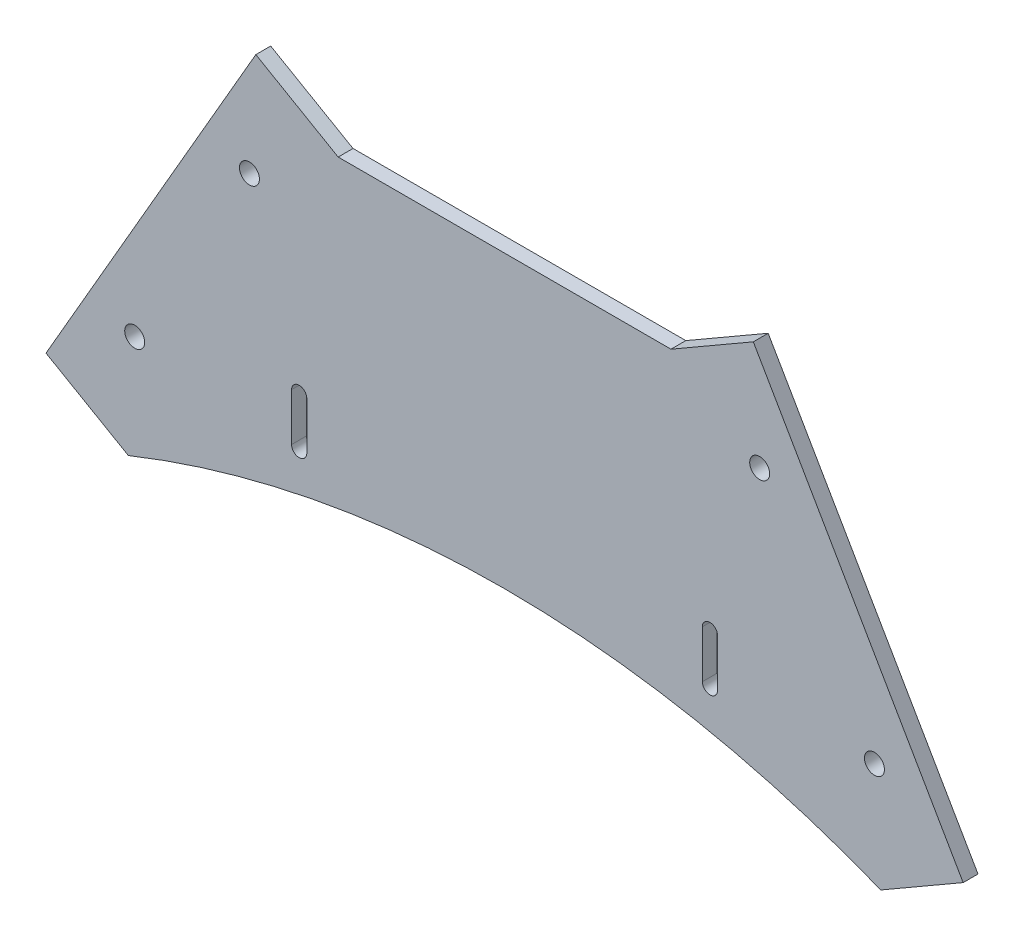
ISO-10303-21;
HEADER;
FILE_DESCRIPTION(('STEP AP214'),'2;1');
FILE_NAME('part.step','',(''),(''),'','','');
FILE_SCHEMA(('AUTOMOTIVE_DESIGN { 1 0 10303 214 1 1 1 1 }'));
ENDSEC;
DATA;
#1=APPLICATION_CONTEXT('core data for automotive mechanical design processes');
#2=APPLICATION_PROTOCOL_DEFINITION('international standard','automotive_design',2000,#1);
#3=PRODUCT_CONTEXT('',#1,'mechanical');
#4=PRODUCT('Part','Part','',(#3));
#5=PRODUCT_RELATED_PRODUCT_CATEGORY('part','',(#4));
#6=PRODUCT_DEFINITION_FORMATION('','',#4);
#7=PRODUCT_DEFINITION_CONTEXT('part definition',#1,'design');
#8=PRODUCT_DEFINITION('design','',#6,#7);
#9=PRODUCT_DEFINITION_SHAPE('','',#8);
#10=(LENGTH_UNIT() NAMED_UNIT(*) SI_UNIT(.MILLI.,.METRE.));
#11=(NAMED_UNIT(*) PLANE_ANGLE_UNIT() SI_UNIT($,.RADIAN.));
#12=(NAMED_UNIT(*) SI_UNIT($,.STERADIAN.) SOLID_ANGLE_UNIT());
#13=UNCERTAINTY_MEASURE_WITH_UNIT(LENGTH_MEASURE(1.E-05),#10,'distance_accuracy_value','');
#14=(GEOMETRIC_REPRESENTATION_CONTEXT(3) GLOBAL_UNCERTAINTY_ASSIGNED_CONTEXT((#13)) GLOBAL_UNIT_ASSIGNED_CONTEXT((#10,
#11,#12)) REPRESENTATION_CONTEXT('',''));
#15=CARTESIAN_POINT('',(0.,0.,0.));
#16=DIRECTION('',(0.,0.,1.));
#17=DIRECTION('',(1.,0.,0.));
#18=AXIS2_PLACEMENT_3D('',#15,#16,#17);
#19=CARTESIAN_POINT('',(96.4557505594944,-196.799575907765,3.125));
#20=DIRECTION('',(0.,0.,1.));
#21=DIRECTION('',(1.,0.,0.));
#22=AXIS2_PLACEMENT_3D('',#19,#20,#21);
#23=PLANE('',#22);
#24=CARTESIAN_POINT('',(150.116004597338,64.1239743106391,3.125));
#25=DIRECTION('',(0.,0.,1.));
#26=DIRECTION('',(1.,0.,0.));
#27=AXIS2_PLACEMENT_3D('',#24,#25,#26);
#28=CIRCLE('',#27,2.09999999999999);
#29=CARTESIAN_POINT('',(152.216004597338,64.1239743106391,3.125));
#30=VERTEX_POINT('',#29);
#31=EDGE_CURVE('E401',#30,#30,#28,.T.);
#32=ORIENTED_EDGE('',*,*,#31,.F.);
#33=EDGE_LOOP('',(#32));
#34=FACE_BOUND('',#33,.T.);
#35=CARTESIAN_POINT('',(42.7954965216511,64.1239743106392,3.125));
#36=DIRECTION('',(0.,0.,1.));
#37=DIRECTION('',(1.,0.,0.));
#38=AXIS2_PLACEMENT_3D('',#35,#36,#37);
#39=CIRCLE('',#38,2.10000000000002);
#40=CARTESIAN_POINT('',(44.8954965216512,64.1239743106392,3.125));
#41=VERTEX_POINT('',#40);
#42=EDGE_CURVE('E175',#41,#41,#39,.T.);
#43=ORIENTED_EDGE('',*,*,#42,.F.);
#44=EDGE_LOOP('',(#43));
#45=FACE_BOUND('',#44,.T.);
#46=CARTESIAN_POINT('',(96.4557505594944,-196.799575907765,3.125));
#47=DIRECTION('',(0.,0.,-1.));
#48=DIRECTION('',(1.,0.,0.));
#49=AXIS2_PLACEMENT_3D('',#46,#47,#48);
#50=CIRCLE('',#49,212.114260907765);
#51=CARTESIAN_POINT('',(17.3205080756887,1.6826817716975E-12,3.125));
#52=VERTEX_POINT('',#51);
#53=CARTESIAN_POINT('',(175.590993043302,1.9550500436325E-12,3.125));
#54=VERTEX_POINT('',#53);
#55=EDGE_CURVE('E216',#52,#54,#50,.T.);
#56=ORIENTED_EDGE('',*,*,#55,.T.);
#57=DIRECTION('',(0.866025403784439,0.499999999999999,0.));
#58=VECTOR('',#57,1.);
#59=CARTESIAN_POINT('',(175.590993043302,1.9550500436325E-12,3.125));
#60=LINE('',#59,#58);
#61=CARTESIAN_POINT('',(192.91150111899,10.0000000000016,3.125));
#62=VERTEX_POINT('',#61);
#63=EDGE_CURVE('E219',#54,#62,#60,.T.);
#64=ORIENTED_EDGE('',*,*,#63,.T.);
#65=DIRECTION('',(-0.499999999999998,0.86602540378444,0.));
#66=VECTOR('',#65,1.);
#67=CARTESIAN_POINT('',(148.776258635184,86.4444823863268,3.125));
#68=LINE('',#67,#66);
#69=CARTESIAN_POINT('',(148.776258635184,86.4444823863268,3.125));
#70=VERTEX_POINT('',#69);
#71=EDGE_CURVE('E222',#62,#70,#68,.T.);
#72=ORIENTED_EDGE('',*,*,#71,.T.);
#73=DIRECTION('',(-0.86602540378444,-0.499999999999997,0.));
#74=VECTOR('',#73,1.);
#75=CARTESIAN_POINT('',(131.455750559495,76.4444823863269,3.125));
#76=LINE('',#75,#74);
#77=CARTESIAN_POINT('',(131.455750559495,76.4444823863269,3.125));
#78=VERTEX_POINT('',#77);
#79=EDGE_CURVE('E224',#70,#78,#76,.T.);
#80=ORIENTED_EDGE('',*,*,#79,.T.);
#81=DIRECTION('',(-1.,0.,0.));
#82=VECTOR('',#81,1.);
#83=CARTESIAN_POINT('',(61.4557505594949,76.4444823863269,3.125));
#84=LINE('',#83,#82);
#85=CARTESIAN_POINT('',(61.4557505594949,76.4444823863269,3.125));
#86=VERTEX_POINT('',#85);
#87=EDGE_CURVE('E226',#78,#86,#84,.T.);
#88=ORIENTED_EDGE('',*,*,#87,.T.);
#89=DIRECTION('',(-0.86602540378444,0.499999999999998,0.));
#90=VECTOR('',#89,1.);
#91=CARTESIAN_POINT('',(61.4557505594949,76.4444823863269,3.125));
#92=LINE('',#91,#90);
#93=CARTESIAN_POINT('',(44.1352424838062,86.4444823863268,3.125));
#94=VERTEX_POINT('',#93);
#95=EDGE_CURVE('E228',#86,#94,#92,.T.);
#96=ORIENTED_EDGE('',*,*,#95,.T.);
#97=DIRECTION('',(-0.499999999999997,-0.86602540378444,0.));
#98=VECTOR('',#97,1.);
#99=CARTESIAN_POINT('',(44.1352424838062,86.4444823863268,3.125));
#100=LINE('',#99,#98);
#101=CARTESIAN_POINT('',(0.,10.0000000000016,3.125));
#102=VERTEX_POINT('',#101);
#103=EDGE_CURVE('E230',#94,#102,#100,.T.);
#104=ORIENTED_EDGE('',*,*,#103,.T.);
#105=DIRECTION('',(0.866025403784439,-0.499999999999999,0.));
#106=VECTOR('',#105,1.);
#107=CARTESIAN_POINT('',(17.3205080756887,1.6826817716975E-12,3.125));
#108=LINE('',#107,#106);
#109=EDGE_CURVE('E232',#102,#52,#108,.T.);
#110=ORIENTED_EDGE('',*,*,#109,.T.);
#111=EDGE_LOOP('',(#56,#64,#72,#80,#88,#96,#104,#110));
#112=FACE_BOUND('',#111,.T.);
#113=DIRECTION('',(0.,-1.,0.));
#114=VECTOR('',#113,1.);
#115=CARTESIAN_POINT('',(51.6557505594943,29.1748337660113,3.125));
#116=LINE('',#115,#114);
#117=CARTESIAN_POINT('',(51.6557505594943,29.1748337660113,3.125));
#118=VERTEX_POINT('',#117);
#119=CARTESIAN_POINT('',(51.6557505594943,19.1748337660114,3.125));
#120=VERTEX_POINT('',#119);
#121=EDGE_CURVE('E187',#118,#120,#116,.T.);
#122=ORIENTED_EDGE('',*,*,#121,.F.);
#123=CARTESIAN_POINT('',(53.2557505594943,29.1748337660113,3.125));
#124=DIRECTION('',(0.,0.,1.));
#125=DIRECTION('',(1.,0.,0.));
#126=AXIS2_PLACEMENT_3D('',#123,#124,#125);
#127=CIRCLE('',#126,1.59999999999999);
#128=CARTESIAN_POINT('',(54.8557505594943,29.1748337660113,3.125));
#129=VERTEX_POINT('',#128);
#130=EDGE_CURVE('E185',#129,#118,#127,.T.);
#131=ORIENTED_EDGE('',*,*,#130,.F.);
#132=DIRECTION('',(0.,1.,0.));
#133=VECTOR('',#132,1.);
#134=CARTESIAN_POINT('',(54.8557505594943,29.1748337660113,3.125));
#135=LINE('',#134,#133);
#136=CARTESIAN_POINT('',(54.8557505594943,19.1748337660114,3.125));
#137=VERTEX_POINT('',#136);
#138=EDGE_CURVE('E193',#137,#129,#135,.T.);
#139=ORIENTED_EDGE('',*,*,#138,.F.);
#140=CARTESIAN_POINT('',(53.2557505594943,19.1748337660114,3.125));
#141=DIRECTION('',(0.,0.,1.));
#142=DIRECTION('',(1.,0.,0.));
#143=AXIS2_PLACEMENT_3D('',#140,#141,#142);
#144=CIRCLE('',#143,1.59999999999999);
#145=EDGE_CURVE('E190',#120,#137,#144,.T.);
#146=ORIENTED_EDGE('',*,*,#145,.F.);
#147=EDGE_LOOP('',(#122,#131,#139,#146));
#148=FACE_BOUND('',#147,.T.);
#149=DIRECTION('',(0.,1.,0.));
#150=VECTOR('',#149,1.);
#151=CARTESIAN_POINT('',(141.255750559494,29.1748337660113,3.125));
#152=LINE('',#151,#150);
#153=CARTESIAN_POINT('',(141.255750559494,19.1748337660114,3.125));
#154=VERTEX_POINT('',#153);
#155=CARTESIAN_POINT('',(141.255750559494,29.1748337660113,3.125));
#156=VERTEX_POINT('',#155);
#157=EDGE_CURVE('E154',#154,#156,#152,.T.);
#158=ORIENTED_EDGE('',*,*,#157,.F.);
#159=CARTESIAN_POINT('',(139.655750559494,19.1748337660114,3.125));
#160=DIRECTION('',(0.,0.,1.));
#161=DIRECTION('',(1.,0.,0.));
#162=AXIS2_PLACEMENT_3D('',#159,#160,#161);
#163=CIRCLE('',#162,1.59999999999999);
#164=CARTESIAN_POINT('',(138.055750559494,19.1748337660114,3.125));
#165=VERTEX_POINT('',#164);
#166=EDGE_CURVE('E146',#165,#154,#163,.T.);
#167=ORIENTED_EDGE('',*,*,#166,.F.);
#168=DIRECTION('',(0.,-1.,0.));
#169=VECTOR('',#168,1.);
#170=CARTESIAN_POINT('',(138.055750559494,29.1748337660113,3.125));
#171=LINE('',#170,#169);
#172=CARTESIAN_POINT('',(138.055750559494,29.1748337660113,3.125));
#173=VERTEX_POINT('',#172);
#174=EDGE_CURVE('E169',#173,#165,#171,.T.);
#175=ORIENTED_EDGE('',*,*,#174,.F.);
#176=CARTESIAN_POINT('',(139.655750559494,29.1748337660113,3.125));
#177=DIRECTION('',(0.,0.,1.));
#178=DIRECTION('',(1.,0.,0.));
#179=AXIS2_PLACEMENT_3D('',#176,#177,#178);
#180=CIRCLE('',#179,1.59999999999999);
#181=EDGE_CURVE('E167',#156,#173,#180,.T.);
#182=ORIENTED_EDGE('',*,*,#181,.F.);
#183=EDGE_LOOP('',(#158,#167,#175,#182));
#184=FACE_BOUND('',#183,.T.);
#185=CARTESIAN_POINT('',(18.6602540378437,22.3205080756896,3.125));
#186=DIRECTION('',(0.,0.,1.));
#187=DIRECTION('',(1.,0.,0.));
#188=AXIS2_PLACEMENT_3D('',#185,#186,#187);
#189=CIRCLE('',#188,2.10000000000001);
#190=CARTESIAN_POINT('',(20.7602540378437,22.3205080756896,3.125));
#191=VERTEX_POINT('',#190);
#192=EDGE_CURVE('E407',#191,#191,#189,.T.);
#193=ORIENTED_EDGE('',*,*,#192,.F.);
#194=EDGE_LOOP('',(#193));
#195=FACE_BOUND('',#194,.T.);
#196=CARTESIAN_POINT('',(174.251247081145,22.3205080756895,3.125));
#197=DIRECTION('',(0.,0.,1.));
#198=DIRECTION('',(1.,0.,0.));
#199=AXIS2_PLACEMENT_3D('',#196,#197,#198);
#200=CIRCLE('',#199,2.09999999999999);
#201=CARTESIAN_POINT('',(176.351247081145,22.3205080756895,3.125));
#202=VERTEX_POINT('',#201);
#203=EDGE_CURVE('E392',#202,#202,#200,.T.);
#204=ORIENTED_EDGE('',*,*,#203,.F.);
#205=EDGE_LOOP('',(#204));
#206=FACE_BOUND('',#205,.T.);
#207=ADVANCED_FACE('F33',(#34,#45,#112,#148,#184,#195,#206),#23,.T.);
#208=CARTESIAN_POINT('',(96.4557505594944,-196.799575907765,0.));
#209=DIRECTION('',(0.,0.,1.));
#210=DIRECTION('',(1.,0.,0.));
#211=AXIS2_PLACEMENT_3D('',#208,#209,#210);
#212=PLANE('',#211);
#213=CARTESIAN_POINT('',(53.2557505594943,29.1748337660113,0.));
#214=DIRECTION('',(0.,0.,1.));
#215=DIRECTION('',(1.,0.,0.));
#216=AXIS2_PLACEMENT_3D('',#213,#214,#215);
#217=CIRCLE('',#216,1.59999999999999);
#218=CARTESIAN_POINT('',(54.8557505594943,29.1748337660113,0.));
#219=VERTEX_POINT('',#218);
#220=CARTESIAN_POINT('',(51.6557505594943,29.1748337660113,0.));
#221=VERTEX_POINT('',#220);
#222=EDGE_CURVE('E162',#219,#221,#217,.T.);
#223=ORIENTED_EDGE('',*,*,#222,.T.);
#224=DIRECTION('',(0.,-1.,0.));
#225=VECTOR('',#224,1.);
#226=CARTESIAN_POINT('',(51.6557505594943,29.1748337660113,0.));
#227=LINE('',#226,#225);
#228=CARTESIAN_POINT('',(51.6557505594943,19.1748337660114,0.));
#229=VERTEX_POINT('',#228);
#230=EDGE_CURVE('E198',#221,#229,#227,.T.);
#231=ORIENTED_EDGE('',*,*,#230,.T.);
#232=CARTESIAN_POINT('',(53.2557505594943,19.1748337660114,0.));
#233=DIRECTION('',(0.,0.,1.));
#234=DIRECTION('',(1.,0.,0.));
#235=AXIS2_PLACEMENT_3D('',#232,#233,#234);
#236=CIRCLE('',#235,1.59999999999999);
#237=CARTESIAN_POINT('',(54.8557505594943,19.1748337660114,0.));
#238=VERTEX_POINT('',#237);
#239=EDGE_CURVE('E201',#229,#238,#236,.T.);
#240=ORIENTED_EDGE('',*,*,#239,.T.);
#241=DIRECTION('',(0.,1.,0.));
#242=VECTOR('',#241,1.);
#243=CARTESIAN_POINT('',(54.8557505594943,29.1748337660113,0.));
#244=LINE('',#243,#242);
#245=EDGE_CURVE('E188',#238,#219,#244,.T.);
#246=ORIENTED_EDGE('',*,*,#245,.T.);
#247=EDGE_LOOP('',(#223,#231,#240,#246));
#248=FACE_BOUND('',#247,.T.);
#249=CARTESIAN_POINT('',(96.4557505594944,-196.799575907765,0.));
#250=DIRECTION('',(0.,0.,-1.));
#251=DIRECTION('',(1.,0.,0.));
#252=AXIS2_PLACEMENT_3D('',#249,#250,#251);
#253=CIRCLE('',#252,212.114260907765);
#254=CARTESIAN_POINT('',(17.3205080756887,1.6826817716975E-12,0.));
#255=VERTEX_POINT('',#254);
#256=CARTESIAN_POINT('',(175.590993043302,1.9550500436325E-12,0.));
#257=VERTEX_POINT('',#256);
#258=EDGE_CURVE('E215',#255,#257,#253,.T.);
#259=ORIENTED_EDGE('',*,*,#258,.F.);
#260=DIRECTION('',(0.866025403784439,-0.499999999999999,0.));
#261=VECTOR('',#260,1.);
#262=CARTESIAN_POINT('',(17.3205080756887,1.6826817716975E-12,0.));
#263=LINE('',#262,#261);
#264=CARTESIAN_POINT('',(0.,10.0000000000016,0.));
#265=VERTEX_POINT('',#264);
#266=EDGE_CURVE('E220',#265,#255,#263,.T.);
#267=ORIENTED_EDGE('',*,*,#266,.F.);
#268=DIRECTION('',(-0.499999999999997,-0.86602540378444,0.));
#269=VECTOR('',#268,1.);
#270=CARTESIAN_POINT('',(44.1352424838062,86.4444823863268,0.));
#271=LINE('',#270,#269);
#272=CARTESIAN_POINT('',(44.1352424838062,86.4444823863268,0.));
#273=VERTEX_POINT('',#272);
#274=EDGE_CURVE('E247',#273,#265,#271,.T.);
#275=ORIENTED_EDGE('',*,*,#274,.F.);
#276=DIRECTION('',(-0.86602540378444,0.499999999999998,0.));
#277=VECTOR('',#276,1.);
#278=CARTESIAN_POINT('',(61.4557505594949,76.4444823863269,0.));
#279=LINE('',#278,#277);
#280=CARTESIAN_POINT('',(61.4557505594949,76.4444823863269,0.));
#281=VERTEX_POINT('',#280);
#282=EDGE_CURVE('E245',#281,#273,#279,.T.);
#283=ORIENTED_EDGE('',*,*,#282,.F.);
#284=DIRECTION('',(-1.,0.,0.));
#285=VECTOR('',#284,1.);
#286=CARTESIAN_POINT('',(61.4557505594949,76.4444823863269,0.));
#287=LINE('',#286,#285);
#288=CARTESIAN_POINT('',(131.455750559495,76.4444823863269,0.));
#289=VERTEX_POINT('',#288);
#290=EDGE_CURVE('E243',#289,#281,#287,.T.);
#291=ORIENTED_EDGE('',*,*,#290,.F.);
#292=DIRECTION('',(-0.86602540378444,-0.499999999999997,0.));
#293=VECTOR('',#292,1.);
#294=CARTESIAN_POINT('',(131.455750559495,76.4444823863269,0.));
#295=LINE('',#294,#293);
#296=CARTESIAN_POINT('',(148.776258635184,86.4444823863268,0.));
#297=VERTEX_POINT('',#296);
#298=EDGE_CURVE('E241',#297,#289,#295,.T.);
#299=ORIENTED_EDGE('',*,*,#298,.F.);
#300=DIRECTION('',(-0.499999999999998,0.86602540378444,0.));
#301=VECTOR('',#300,1.);
#302=CARTESIAN_POINT('',(148.776258635184,86.4444823863268,0.));
#303=LINE('',#302,#301);
#304=CARTESIAN_POINT('',(192.91150111899,10.0000000000016,0.));
#305=VERTEX_POINT('',#304);
#306=EDGE_CURVE('E239',#305,#297,#303,.T.);
#307=ORIENTED_EDGE('',*,*,#306,.F.);
#308=DIRECTION('',(0.866025403784439,0.499999999999999,0.));
#309=VECTOR('',#308,1.);
#310=CARTESIAN_POINT('',(175.590993043302,1.9550500436325E-12,0.));
#311=LINE('',#310,#309);
#312=EDGE_CURVE('E237',#257,#305,#311,.T.);
#313=ORIENTED_EDGE('',*,*,#312,.F.);
#314=EDGE_LOOP('',(#259,#267,#275,#283,#291,#299,#307,#313));
#315=FACE_BOUND('',#314,.T.);
#316=CARTESIAN_POINT('',(139.655750559494,19.1748337660114,0.));
#317=DIRECTION('',(0.,0.,1.));
#318=DIRECTION('',(1.,0.,0.));
#319=AXIS2_PLACEMENT_3D('',#316,#317,#318);
#320=CIRCLE('',#319,1.59999999999999);
#321=CARTESIAN_POINT('',(138.055750559494,19.1748337660114,0.));
#322=VERTEX_POINT('',#321);
#323=CARTESIAN_POINT('',(141.255750559494,19.1748337660114,0.));
#324=VERTEX_POINT('',#323);
#325=EDGE_CURVE('E56',#322,#324,#320,.T.);
#326=ORIENTED_EDGE('',*,*,#325,.T.);
#327=DIRECTION('',(0.,1.,0.));
#328=VECTOR('',#327,1.);
#329=CARTESIAN_POINT('',(141.255750559494,29.1748337660113,0.));
#330=LINE('',#329,#328);
#331=CARTESIAN_POINT('',(141.255750559494,29.1748337660113,0.));
#332=VERTEX_POINT('',#331);
#333=EDGE_CURVE('E161',#324,#332,#330,.T.);
#334=ORIENTED_EDGE('',*,*,#333,.T.);
#335=CARTESIAN_POINT('',(139.655750559494,29.1748337660113,0.));
#336=DIRECTION('',(0.,0.,1.));
#337=DIRECTION('',(1.,0.,0.));
#338=AXIS2_PLACEMENT_3D('',#335,#336,#337);
#339=CIRCLE('',#338,1.59999999999999);
#340=CARTESIAN_POINT('',(138.055750559494,29.1748337660113,0.));
#341=VERTEX_POINT('',#340);
#342=EDGE_CURVE('E177',#332,#341,#339,.T.);
#343=ORIENTED_EDGE('',*,*,#342,.T.);
#344=DIRECTION('',(0.,-1.,0.));
#345=VECTOR('',#344,1.);
#346=CARTESIAN_POINT('',(138.055750559494,29.1748337660113,0.));
#347=LINE('',#346,#345);
#348=EDGE_CURVE('E155',#341,#322,#347,.T.);
#349=ORIENTED_EDGE('',*,*,#348,.T.);
#350=EDGE_LOOP('',(#326,#334,#343,#349));
#351=FACE_BOUND('',#350,.T.);
#352=CARTESIAN_POINT('',(42.7954965216511,64.1239743106392,0.));
#353=DIRECTION('',(0.,0.,1.));
#354=DIRECTION('',(1.,0.,0.));
#355=AXIS2_PLACEMENT_3D('',#352,#353,#354);
#356=CIRCLE('',#355,2.10000000000002);
#357=CARTESIAN_POINT('',(44.8954965216512,64.1239743106392,0.));
#358=VERTEX_POINT('',#357);
#359=EDGE_CURVE('E410',#358,#358,#356,.T.);
#360=ORIENTED_EDGE('',*,*,#359,.T.);
#361=EDGE_LOOP('',(#360));
#362=FACE_BOUND('',#361,.T.);
#363=CARTESIAN_POINT('',(18.6602540378437,22.3205080756896,0.));
#364=DIRECTION('',(0.,0.,1.));
#365=DIRECTION('',(1.,0.,0.));
#366=AXIS2_PLACEMENT_3D('',#363,#364,#365);
#367=CIRCLE('',#366,2.10000000000001);
#368=CARTESIAN_POINT('',(20.7602540378437,22.3205080756896,0.));
#369=VERTEX_POINT('',#368);
#370=EDGE_CURVE('E404',#369,#369,#367,.T.);
#371=ORIENTED_EDGE('',*,*,#370,.T.);
#372=EDGE_LOOP('',(#371));
#373=FACE_BOUND('',#372,.T.);
#374=CARTESIAN_POINT('',(150.116004597338,64.1239743106391,0.));
#375=DIRECTION('',(0.,0.,1.));
#376=DIRECTION('',(1.,0.,0.));
#377=AXIS2_PLACEMENT_3D('',#374,#375,#376);
#378=CIRCLE('',#377,2.09999999999999);
#379=CARTESIAN_POINT('',(152.216004597338,64.1239743106391,0.));
#380=VERTEX_POINT('',#379);
#381=EDGE_CURVE('E398',#380,#380,#378,.T.);
#382=ORIENTED_EDGE('',*,*,#381,.T.);
#383=EDGE_LOOP('',(#382));
#384=FACE_BOUND('',#383,.T.);
#385=CARTESIAN_POINT('',(174.251247081145,22.3205080756895,0.));
#386=DIRECTION('',(0.,0.,1.));
#387=DIRECTION('',(1.,0.,0.));
#388=AXIS2_PLACEMENT_3D('',#385,#386,#387);
#389=CIRCLE('',#388,2.09999999999999);
#390=CARTESIAN_POINT('',(176.351247081145,22.3205080756895,0.));
#391=VERTEX_POINT('',#390);
#392=EDGE_CURVE('E395',#391,#391,#389,.T.);
#393=ORIENTED_EDGE('',*,*,#392,.T.);
#394=EDGE_LOOP('',(#393));
#395=FACE_BOUND('',#394,.T.);
#396=ADVANCED_FACE('F277',(#248,#315,#351,#362,#373,#384,#395),#212,.F.);
#397=CARTESIAN_POINT('',(96.4557505594944,-196.799575907765,3.125));
#398=DIRECTION('',(0.,0.,-1.));
#399=DIRECTION('',(-1.,0.,0.));
#400=AXIS2_PLACEMENT_3D('',#397,#398,#399);
#401=CYLINDRICAL_SURFACE('',#400,212.114260907765);
#402=ORIENTED_EDGE('',*,*,#258,.T.);
#403=DIRECTION('',(0.,0.,-1.));
#404=VECTOR('',#403,1.);
#405=CARTESIAN_POINT('',(175.590993043302,1.9550500436325E-12,3.125));
#406=LINE('',#405,#404);
#407=EDGE_CURVE('E11',#54,#257,#406,.T.);
#408=ORIENTED_EDGE('',*,*,#407,.F.);
#409=ORIENTED_EDGE('',*,*,#55,.F.);
#410=DIRECTION('',(0.,0.,-1.));
#411=VECTOR('',#410,1.);
#412=CARTESIAN_POINT('',(17.3205080756887,1.6826817716975E-12,3.125));
#413=LINE('',#412,#411);
#414=EDGE_CURVE('E234',#52,#255,#413,.T.);
#415=ORIENTED_EDGE('',*,*,#414,.T.);
#416=EDGE_LOOP('',(#402,#408,#409,#415));
#417=FACE_BOUND('',#416,.T.);
#418=ADVANCED_FACE('F35',(#417),#401,.F.);
#419=CARTESIAN_POINT('',(175.590993043302,1.9550500436325E-12,3.125));
#420=DIRECTION('',(-0.499999999999999,0.866025403784439,0.));
#421=DIRECTION('',(-0.866025403784439,-0.499999999999999,0.));
#422=AXIS2_PLACEMENT_3D('',#419,#420,#421);
#423=PLANE('',#422);
#424=ORIENTED_EDGE('',*,*,#312,.T.);
#425=DIRECTION('',(0.,0.,-1.));
#426=VECTOR('',#425,1.);
#427=CARTESIAN_POINT('',(192.91150111899,10.0000000000016,3.125));
#428=LINE('',#427,#426);
#429=EDGE_CURVE('E41',#62,#305,#428,.T.);
#430=ORIENTED_EDGE('',*,*,#429,.F.);
#431=ORIENTED_EDGE('',*,*,#63,.F.);
#432=ORIENTED_EDGE('',*,*,#407,.T.);
#433=EDGE_LOOP('',(#424,#430,#431,#432));
#434=FACE_BOUND('',#433,.T.);
#435=ADVANCED_FACE('F295',(#434),#423,.F.);
#436=CARTESIAN_POINT('',(148.776258635184,86.4444823863268,3.125));
#437=DIRECTION('',(-0.86602540378444,-0.499999999999998,0.));
#438=DIRECTION('',(0.499999999999998,-0.86602540378444,0.));
#439=AXIS2_PLACEMENT_3D('',#436,#437,#438);
#440=PLANE('',#439);
#441=ORIENTED_EDGE('',*,*,#306,.T.);
#442=DIRECTION('',(0.,0.,-1.));
#443=VECTOR('',#442,1.);
#444=CARTESIAN_POINT('',(148.776258635184,86.4444823863268,3.125));
#445=LINE('',#444,#443);
#446=EDGE_CURVE('E264',#70,#297,#445,.T.);
#447=ORIENTED_EDGE('',*,*,#446,.F.);
#448=ORIENTED_EDGE('',*,*,#71,.F.);
#449=ORIENTED_EDGE('',*,*,#429,.T.);
#450=EDGE_LOOP('',(#441,#447,#448,#449));
#451=FACE_BOUND('',#450,.T.);
#452=ADVANCED_FACE('F271',(#451),#440,.F.);
#453=CARTESIAN_POINT('',(131.455750559495,76.4444823863269,3.125));
#454=DIRECTION('',(0.499999999999997,-0.86602540378444,0.));
#455=DIRECTION('',(0.86602540378444,0.499999999999997,0.));
#456=AXIS2_PLACEMENT_3D('',#453,#454,#455);
#457=PLANE('',#456);
#458=ORIENTED_EDGE('',*,*,#298,.T.);
#459=DIRECTION('',(0.,0.,-1.));
#460=VECTOR('',#459,1.);
#461=CARTESIAN_POINT('',(131.455750559495,76.4444823863269,3.125));
#462=LINE('',#461,#460);
#463=EDGE_CURVE('E261',#78,#289,#462,.T.);
#464=ORIENTED_EDGE('',*,*,#463,.F.);
#465=ORIENTED_EDGE('',*,*,#79,.F.);
#466=ORIENTED_EDGE('',*,*,#446,.T.);
#467=EDGE_LOOP('',(#458,#464,#465,#466));
#468=FACE_BOUND('',#467,.T.);
#469=ADVANCED_FACE('F283',(#468),#457,.F.);
#470=CARTESIAN_POINT('',(61.4557505594949,76.4444823863269,3.125));
#471=DIRECTION('',(0.,-1.,0.));
#472=DIRECTION('',(1.,0.,0.));
#473=AXIS2_PLACEMENT_3D('',#470,#471,#472);
#474=PLANE('',#473);
#475=ORIENTED_EDGE('',*,*,#290,.T.);
#476=DIRECTION('',(0.,0.,-1.));
#477=VECTOR('',#476,1.);
#478=CARTESIAN_POINT('',(61.4557505594949,76.4444823863269,3.125));
#479=LINE('',#478,#477);
#480=EDGE_CURVE('E258',#86,#281,#479,.T.);
#481=ORIENTED_EDGE('',*,*,#480,.F.);
#482=ORIENTED_EDGE('',*,*,#87,.F.);
#483=ORIENTED_EDGE('',*,*,#463,.T.);
#484=EDGE_LOOP('',(#475,#481,#482,#483));
#485=FACE_BOUND('',#484,.T.);
#486=ADVANCED_FACE('F287',(#485),#474,.F.);
#487=CARTESIAN_POINT('',(61.4557505594949,76.4444823863269,3.125));
#488=DIRECTION('',(-0.499999999999998,-0.86602540378444,0.));
#489=DIRECTION('',(0.86602540378444,-0.499999999999998,0.));
#490=AXIS2_PLACEMENT_3D('',#487,#488,#489);
#491=PLANE('',#490);
#492=ORIENTED_EDGE('',*,*,#282,.T.);
#493=DIRECTION('',(0.,0.,-1.));
#494=VECTOR('',#493,1.);
#495=CARTESIAN_POINT('',(44.1352424838062,86.4444823863268,3.125));
#496=LINE('',#495,#494);
#497=EDGE_CURVE('E255',#94,#273,#496,.T.);
#498=ORIENTED_EDGE('',*,*,#497,.F.);
#499=ORIENTED_EDGE('',*,*,#95,.F.);
#500=ORIENTED_EDGE('',*,*,#480,.T.);
#501=EDGE_LOOP('',(#492,#498,#499,#500));
#502=FACE_BOUND('',#501,.T.);
#503=ADVANCED_FACE('F308',(#502),#491,.F.);
#504=CARTESIAN_POINT('',(44.1352424838062,86.4444823863268,3.125));
#505=DIRECTION('',(0.86602540378444,-0.499999999999997,0.));
#506=DIRECTION('',(0.499999999999997,0.86602540378444,0.));
#507=AXIS2_PLACEMENT_3D('',#504,#505,#506);
#508=PLANE('',#507);
#509=ORIENTED_EDGE('',*,*,#274,.T.);
#510=DIRECTION('',(0.,0.,-1.));
#511=VECTOR('',#510,1.);
#512=CARTESIAN_POINT('',(0.,10.0000000000016,3.125));
#513=LINE('',#512,#511);
#514=EDGE_CURVE('E252',#102,#265,#513,.T.);
#515=ORIENTED_EDGE('',*,*,#514,.F.);
#516=ORIENTED_EDGE('',*,*,#103,.F.);
#517=ORIENTED_EDGE('',*,*,#497,.T.);
#518=EDGE_LOOP('',(#509,#515,#516,#517));
#519=FACE_BOUND('',#518,.T.);
#520=ADVANCED_FACE('F306',(#519),#508,.F.);
#521=CARTESIAN_POINT('',(17.3205080756887,1.6826817716975E-12,3.125));
#522=DIRECTION('',(0.499999999999999,0.866025403784439,0.));
#523=DIRECTION('',(-0.866025403784439,0.499999999999999,0.));
#524=AXIS2_PLACEMENT_3D('',#521,#522,#523);
#525=PLANE('',#524);
#526=ORIENTED_EDGE('',*,*,#266,.T.);
#527=ORIENTED_EDGE('',*,*,#414,.F.);
#528=ORIENTED_EDGE('',*,*,#109,.F.);
#529=ORIENTED_EDGE('',*,*,#514,.T.);
#530=EDGE_LOOP('',(#526,#527,#528,#529));
#531=FACE_BOUND('',#530,.T.);
#532=ADVANCED_FACE('F301',(#531),#525,.F.);
#533=CARTESIAN_POINT('',(53.2557505594943,29.1748337660113,3.125));
#534=DIRECTION('',(0.,0.,-1.));
#535=DIRECTION('',(-1.,0.,0.));
#536=AXIS2_PLACEMENT_3D('',#533,#534,#535);
#537=CYLINDRICAL_SURFACE('',#536,1.59999999999999);
#538=ORIENTED_EDGE('',*,*,#222,.F.);
#539=DIRECTION('',(0.,0.,-1.));
#540=VECTOR('',#539,1.);
#541=CARTESIAN_POINT('',(54.8557505594943,29.1748337660113,3.125));
#542=LINE('',#541,#540);
#543=EDGE_CURVE('E195',#129,#219,#542,.T.);
#544=ORIENTED_EDGE('',*,*,#543,.F.);
#545=ORIENTED_EDGE('',*,*,#130,.T.);
#546=DIRECTION('',(0.,0.,-1.));
#547=VECTOR('',#546,1.);
#548=CARTESIAN_POINT('',(51.6557505594943,29.1748337660113,3.125));
#549=LINE('',#548,#547);
#550=EDGE_CURVE('E212',#118,#221,#549,.T.);
#551=ORIENTED_EDGE('',*,*,#550,.T.);
#552=EDGE_LOOP('',(#538,#544,#545,#551));
#553=FACE_BOUND('',#552,.T.);
#554=ADVANCED_FACE('F328',(#553),#537,.F.);
#555=CARTESIAN_POINT('',(51.6557505594943,29.1748337660113,3.125));
#556=DIRECTION('',(1.,0.,0.));
#557=DIRECTION('',(0.,0.,-1.));
#558=AXIS2_PLACEMENT_3D('',#555,#556,#557);
#559=PLANE('',#558);
#560=ORIENTED_EDGE('',*,*,#230,.F.);
#561=ORIENTED_EDGE('',*,*,#550,.F.);
#562=ORIENTED_EDGE('',*,*,#121,.T.);
#563=DIRECTION('',(0.,0.,-1.));
#564=VECTOR('',#563,1.);
#565=CARTESIAN_POINT('',(51.6557505594943,19.1748337660114,3.125));
#566=LINE('',#565,#564);
#567=EDGE_CURVE('E210',#120,#229,#566,.T.);
#568=ORIENTED_EDGE('',*,*,#567,.T.);
#569=EDGE_LOOP('',(#560,#561,#562,#568));
#570=FACE_BOUND('',#569,.T.);
#571=ADVANCED_FACE('F335',(#570),#559,.T.);
#572=CARTESIAN_POINT('',(53.2557505594943,19.1748337660114,3.125));
#573=DIRECTION('',(0.,0.,-1.));
#574=DIRECTION('',(-1.,0.,0.));
#575=AXIS2_PLACEMENT_3D('',#572,#573,#574);
#576=CYLINDRICAL_SURFACE('',#575,1.59999999999999);
#577=ORIENTED_EDGE('',*,*,#239,.F.);
#578=ORIENTED_EDGE('',*,*,#567,.F.);
#579=ORIENTED_EDGE('',*,*,#145,.T.);
#580=DIRECTION('',(0.,0.,-1.));
#581=VECTOR('',#580,1.);
#582=CARTESIAN_POINT('',(54.8557505594943,19.1748337660114,3.125));
#583=LINE('',#582,#581);
#584=EDGE_CURVE('E208',#137,#238,#583,.T.);
#585=ORIENTED_EDGE('',*,*,#584,.T.);
#586=EDGE_LOOP('',(#577,#578,#579,#585));
#587=FACE_BOUND('',#586,.T.);
#588=ADVANCED_FACE('F340',(#587),#576,.F.);
#589=CARTESIAN_POINT('',(54.8557505594943,29.1748337660113,3.125));
#590=DIRECTION('',(-1.,0.,0.));
#591=DIRECTION('',(0.,0.,1.));
#592=AXIS2_PLACEMENT_3D('',#589,#590,#591);
#593=PLANE('',#592);
#594=ORIENTED_EDGE('',*,*,#245,.F.);
#595=ORIENTED_EDGE('',*,*,#584,.F.);
#596=ORIENTED_EDGE('',*,*,#138,.T.);
#597=ORIENTED_EDGE('',*,*,#543,.T.);
#598=EDGE_LOOP('',(#594,#595,#596,#597));
#599=FACE_BOUND('',#598,.T.);
#600=ADVANCED_FACE('F347',(#599),#593,.T.);
#601=CARTESIAN_POINT('',(139.655750559494,19.1748337660114,3.125));
#602=DIRECTION('',(0.,0.,-1.));
#603=DIRECTION('',(-1.,0.,0.));
#604=AXIS2_PLACEMENT_3D('',#601,#602,#603);
#605=CYLINDRICAL_SURFACE('',#604,1.59999999999999);
#606=ORIENTED_EDGE('',*,*,#325,.F.);
#607=DIRECTION('',(0.,0.,-1.));
#608=VECTOR('',#607,1.);
#609=CARTESIAN_POINT('',(138.055750559494,19.1748337660114,3.125));
#610=LINE('',#609,#608);
#611=EDGE_CURVE('E150',#165,#322,#610,.T.);
#612=ORIENTED_EDGE('',*,*,#611,.F.);
#613=ORIENTED_EDGE('',*,*,#166,.T.);
#614=DIRECTION('',(0.,0.,-1.));
#615=VECTOR('',#614,1.);
#616=CARTESIAN_POINT('',(141.255750559494,19.1748337660114,3.125));
#617=LINE('',#616,#615);
#618=EDGE_CURVE('E149',#154,#324,#617,.T.);
#619=ORIENTED_EDGE('',*,*,#618,.T.);
#620=EDGE_LOOP('',(#606,#612,#613,#619));
#621=FACE_BOUND('',#620,.T.);
#622=ADVANCED_FACE('F148',(#621),#605,.F.);
#623=CARTESIAN_POINT('',(141.255750559494,29.1748337660113,3.125));
#624=DIRECTION('',(-1.,0.,0.));
#625=DIRECTION('',(0.,0.,1.));
#626=AXIS2_PLACEMENT_3D('',#623,#624,#625);
#627=PLANE('',#626);
#628=ORIENTED_EDGE('',*,*,#333,.F.);
#629=ORIENTED_EDGE('',*,*,#618,.F.);
#630=ORIENTED_EDGE('',*,*,#157,.T.);
#631=DIRECTION('',(0.,0.,-1.));
#632=VECTOR('',#631,1.);
#633=CARTESIAN_POINT('',(141.255750559494,29.1748337660113,3.125));
#634=LINE('',#633,#632);
#635=EDGE_CURVE('E163',#156,#332,#634,.T.);
#636=ORIENTED_EDGE('',*,*,#635,.T.);
#637=EDGE_LOOP('',(#628,#629,#630,#636));
#638=FACE_BOUND('',#637,.T.);
#639=ADVANCED_FACE('F158',(#638),#627,.T.);
#640=CARTESIAN_POINT('',(139.655750559494,29.1748337660113,3.125));
#641=DIRECTION('',(0.,0.,-1.));
#642=DIRECTION('',(-1.,0.,0.));
#643=AXIS2_PLACEMENT_3D('',#640,#641,#642);
#644=CYLINDRICAL_SURFACE('',#643,1.59999999999999);
#645=ORIENTED_EDGE('',*,*,#342,.F.);
#646=ORIENTED_EDGE('',*,*,#635,.F.);
#647=ORIENTED_EDGE('',*,*,#181,.T.);
#648=DIRECTION('',(0.,0.,-1.));
#649=VECTOR('',#648,1.);
#650=CARTESIAN_POINT('',(138.055750559494,29.1748337660113,3.125));
#651=LINE('',#650,#649);
#652=EDGE_CURVE('E48',#173,#341,#651,.T.);
#653=ORIENTED_EDGE('',*,*,#652,.T.);
#654=EDGE_LOOP('',(#645,#646,#647,#653));
#655=FACE_BOUND('',#654,.T.);
#656=ADVANCED_FACE('F365',(#655),#644,.F.);
#657=CARTESIAN_POINT('',(138.055750559494,29.1748337660113,3.125));
#658=DIRECTION('',(1.,0.,0.));
#659=DIRECTION('',(0.,0.,-1.));
#660=AXIS2_PLACEMENT_3D('',#657,#658,#659);
#661=PLANE('',#660);
#662=ORIENTED_EDGE('',*,*,#348,.F.);
#663=ORIENTED_EDGE('',*,*,#652,.F.);
#664=ORIENTED_EDGE('',*,*,#174,.T.);
#665=ORIENTED_EDGE('',*,*,#611,.T.);
#666=EDGE_LOOP('',(#662,#663,#664,#665));
#667=FACE_BOUND('',#666,.T.);
#668=ADVANCED_FACE('F368',(#667),#661,.T.);
#669=CARTESIAN_POINT('',(42.7954965216511,64.1239743106392,3.125));
#670=DIRECTION('',(0.,0.,-1.));
#671=DIRECTION('',(-1.,0.,0.));
#672=AXIS2_PLACEMENT_3D('',#669,#670,#671);
#673=CYLINDRICAL_SURFACE('',#672,2.10000000000002);
#674=ORIENTED_EDGE('',*,*,#42,.T.);
#675=EDGE_LOOP('',(#674));
#676=FACE_BOUND('',#675,.T.);
#677=ORIENTED_EDGE('',*,*,#359,.F.);
#678=EDGE_LOOP('',(#677));
#679=FACE_BOUND('',#678,.T.);
#680=ADVANCED_FACE('F372',(#676,#679),#673,.F.);
#681=CARTESIAN_POINT('',(18.6602540378437,22.3205080756896,3.125));
#682=DIRECTION('',(0.,0.,-1.));
#683=DIRECTION('',(-1.,0.,0.));
#684=AXIS2_PLACEMENT_3D('',#681,#682,#683);
#685=CYLINDRICAL_SURFACE('',#684,2.10000000000001);
#686=ORIENTED_EDGE('',*,*,#192,.T.);
#687=EDGE_LOOP('',(#686));
#688=FACE_BOUND('',#687,.T.);
#689=ORIENTED_EDGE('',*,*,#370,.F.);
#690=EDGE_LOOP('',(#689));
#691=FACE_BOUND('',#690,.T.);
#692=ADVANCED_FACE('F375',(#688,#691),#685,.F.);
#693=CARTESIAN_POINT('',(150.116004597338,64.1239743106391,3.125));
#694=DIRECTION('',(0.,0.,-1.));
#695=DIRECTION('',(-1.,0.,0.));
#696=AXIS2_PLACEMENT_3D('',#693,#694,#695);
#697=CYLINDRICAL_SURFACE('',#696,2.09999999999999);
#698=ORIENTED_EDGE('',*,*,#31,.T.);
#699=EDGE_LOOP('',(#698));
#700=FACE_BOUND('',#699,.T.);
#701=ORIENTED_EDGE('',*,*,#381,.F.);
#702=EDGE_LOOP('',(#701));
#703=FACE_BOUND('',#702,.T.);
#704=ADVANCED_FACE('F379',(#700,#703),#697,.F.);
#705=CARTESIAN_POINT('',(174.251247081145,22.3205080756895,3.125));
#706=DIRECTION('',(0.,0.,-1.));
#707=DIRECTION('',(-1.,0.,0.));
#708=AXIS2_PLACEMENT_3D('',#705,#706,#707);
#709=CYLINDRICAL_SURFACE('',#708,2.09999999999999);
#710=ORIENTED_EDGE('',*,*,#203,.T.);
#711=EDGE_LOOP('',(#710));
#712=FACE_BOUND('',#711,.T.);
#713=ORIENTED_EDGE('',*,*,#392,.F.);
#714=EDGE_LOOP('',(#713));
#715=FACE_BOUND('',#714,.T.);
#716=ADVANCED_FACE('F383',(#712,#715),#709,.F.);
#717=CLOSED_SHELL('',(#207,#396,#418,#435,#452,#469,#486,#503,#520,#532,#554,#571,#588,#600,
#622,#639,#656,#668,#680,#692,#704,#716));
#718=MANIFOLD_SOLID_BREP('B2',#717);
#719=ADVANCED_BREP_SHAPE_REPRESENTATION('',(#18,#718),#14);
#720=SHAPE_DEFINITION_REPRESENTATION(#9,#719);
ENDSEC;
END-ISO-10303-21;
